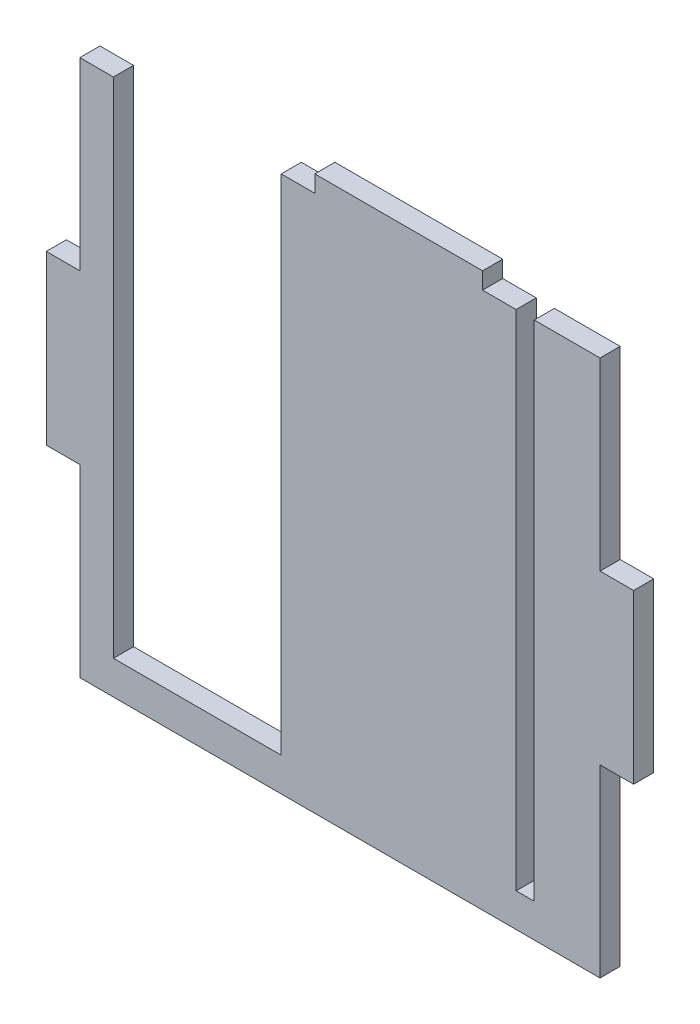
ISO-10303-21;
HEADER;
FILE_DESCRIPTION(('STEP AP214'),'2;1');
FILE_NAME('part.step','',(''),(''),'','','');
FILE_SCHEMA(('AUTOMOTIVE_DESIGN { 1 0 10303 214 1 1 1 1 }'));
ENDSEC;
DATA;
#1=APPLICATION_CONTEXT('core data for automotive mechanical design processes');
#2=APPLICATION_PROTOCOL_DEFINITION('international standard','automotive_design',2000,#1);
#3=PRODUCT_CONTEXT('',#1,'mechanical');
#4=PRODUCT('Part','Part','',(#3));
#5=PRODUCT_RELATED_PRODUCT_CATEGORY('part','',(#4));
#6=PRODUCT_DEFINITION_FORMATION('','',#4);
#7=PRODUCT_DEFINITION_CONTEXT('part definition',#1,'design');
#8=PRODUCT_DEFINITION('design','',#6,#7);
#9=PRODUCT_DEFINITION_SHAPE('','',#8);
#10=(LENGTH_UNIT() NAMED_UNIT(*) SI_UNIT(.MILLI.,.METRE.));
#11=(NAMED_UNIT(*) PLANE_ANGLE_UNIT() SI_UNIT($,.RADIAN.));
#12=(NAMED_UNIT(*) SI_UNIT($,.STERADIAN.) SOLID_ANGLE_UNIT());
#13=UNCERTAINTY_MEASURE_WITH_UNIT(LENGTH_MEASURE(1.E-05),#10,'distance_accuracy_value','');
#14=(GEOMETRIC_REPRESENTATION_CONTEXT(3) GLOBAL_UNCERTAINTY_ASSIGNED_CONTEXT((#13)) GLOBAL_UNIT_ASSIGNED_CONTEXT((#10,
#11,#12)) REPRESENTATION_CONTEXT('',''));
#15=CARTESIAN_POINT('',(0.,0.,0.));
#16=DIRECTION('',(0.,0.,1.));
#17=DIRECTION('',(1.,0.,0.));
#18=AXIS2_PLACEMENT_3D('',#15,#16,#17);
#19=CARTESIAN_POINT('',(0.,160.,6.));
#20=DIRECTION('',(0.,-1.,0.));
#21=DIRECTION('',(1.,0.,0.));
#22=AXIS2_PLACEMENT_3D('',#19,#20,#21);
#23=PLANE('',#22);
#24=DIRECTION('',(0.,0.,-1.));
#25=VECTOR('',#24,1.);
#26=CARTESIAN_POINT('',(-35.,160.,6.));
#27=LINE('',#26,#25);
#28=CARTESIAN_POINT('',(-35.,160.,6.));
#29=VERTEX_POINT('',#28);
#30=CARTESIAN_POINT('',(-35.,160.,0.));
#31=VERTEX_POINT('',#30);
#32=EDGE_CURVE('E128',#29,#31,#27,.T.);
#33=ORIENTED_EDGE('',*,*,#32,.F.);
#34=DIRECTION('',(-1.,0.,0.));
#35=VECTOR('',#34,1.);
#36=CARTESIAN_POINT('',(0.,160.,6.));
#37=LINE('',#36,#35);
#38=CARTESIAN_POINT('',(-25.,160.,6.));
#39=VERTEX_POINT('',#38);
#40=EDGE_CURVE('E407',#39,#29,#37,.T.);
#41=ORIENTED_EDGE('',*,*,#40,.F.);
#42=DIRECTION('',(0.,0.,-1.));
#43=VECTOR('',#42,1.);
#44=CARTESIAN_POINT('',(-25.,160.,6.));
#45=LINE('',#44,#43);
#46=CARTESIAN_POINT('',(-25.,160.,0.));
#47=VERTEX_POINT('',#46);
#48=EDGE_CURVE('E271',#39,#47,#45,.T.);
#49=ORIENTED_EDGE('',*,*,#48,.T.);
#50=DIRECTION('',(-1.,0.,0.));
#51=VECTOR('',#50,1.);
#52=CARTESIAN_POINT('',(0.,160.,0.));
#53=LINE('',#52,#51);
#54=EDGE_CURVE('E341',#47,#31,#53,.T.);
#55=ORIENTED_EDGE('',*,*,#54,.T.);
#56=EDGE_LOOP('',(#33,#41,#49,#55));
#57=FACE_BOUND('',#56,.T.);
#58=ADVANCED_FACE('F117',(#57),#23,.F.);
#59=CARTESIAN_POINT('',(-85.,160.,6.));
#60=VERTEX_POINT('',#59);
#61=CARTESIAN_POINT('',(-95.0000000000001,160.,6.));
#62=VERTEX_POINT('',#61);
#63=EDGE_CURVE('E280',#60,#62,#37,.T.);
#64=ORIENTED_EDGE('',*,*,#63,.F.);
#65=DIRECTION('',(0.,0.,-1.));
#66=VECTOR('',#65,1.);
#67=CARTESIAN_POINT('',(-85.,160.,6.));
#68=LINE('',#67,#66);
#69=CARTESIAN_POINT('',(-85.,160.,0.));
#70=VERTEX_POINT('',#69);
#71=EDGE_CURVE('E12',#60,#70,#68,.T.);
#72=ORIENTED_EDGE('',*,*,#71,.T.);
#73=CARTESIAN_POINT('',(-95.0000000000001,160.,0.));
#74=VERTEX_POINT('',#73);
#75=EDGE_CURVE('E166',#70,#74,#53,.T.);
#76=ORIENTED_EDGE('',*,*,#75,.T.);
#77=DIRECTION('',(0.,0.,-1.));
#78=VECTOR('',#77,1.);
#79=CARTESIAN_POINT('',(-95.0000000000001,160.,6.));
#80=LINE('',#79,#78);
#81=EDGE_CURVE('E195',#62,#74,#80,.T.);
#82=ORIENTED_EDGE('',*,*,#81,.F.);
#83=EDGE_LOOP('',(#64,#72,#76,#82));
#84=FACE_BOUND('',#83,.T.);
#85=ADVANCED_FACE('F504',(#84),#23,.F.);
#86=CARTESIAN_POINT('',(-95.0000000000001,0.,6.));
#87=DIRECTION('',(1.,0.,0.));
#88=DIRECTION('',(0.,0.,-1.));
#89=AXIS2_PLACEMENT_3D('',#86,#87,#88);
#90=PLANE('',#89);
#91=DIRECTION('',(0.,-1.,0.));
#92=VECTOR('',#91,1.);
#93=CARTESIAN_POINT('',(-95.0000000000001,0.,0.));
#94=LINE('',#93,#92);
#95=CARTESIAN_POINT('',(-95.0000000000001,9.99999999999998,0.));
#96=VERTEX_POINT('',#95);
#97=EDGE_CURVE('E337',#74,#96,#94,.T.);
#98=ORIENTED_EDGE('',*,*,#97,.T.);
#99=DIRECTION('',(0.,0.,-1.));
#100=VECTOR('',#99,1.);
#101=CARTESIAN_POINT('',(-95.0000000000001,9.99999999999998,6.));
#102=LINE('',#101,#100);
#103=CARTESIAN_POINT('',(-95.0000000000001,9.99999999999998,6.));
#104=VERTEX_POINT('',#103);
#105=EDGE_CURVE('E199',#104,#96,#102,.T.);
#106=ORIENTED_EDGE('',*,*,#105,.F.);
#107=DIRECTION('',(0.,-1.,0.));
#108=VECTOR('',#107,1.);
#109=CARTESIAN_POINT('',(-95.0000000000001,0.,6.));
#110=LINE('',#109,#108);
#111=EDGE_CURVE('E403',#62,#104,#110,.T.);
#112=ORIENTED_EDGE('',*,*,#111,.F.);
#113=ORIENTED_EDGE('',*,*,#81,.T.);
#114=EDGE_LOOP('',(#98,#106,#112,#113));
#115=FACE_BOUND('',#114,.T.);
#116=ADVANCED_FACE('F568',(#115),#90,.F.);
#117=CARTESIAN_POINT('',(0.,9.99999999999998,6.));
#118=DIRECTION('',(0.,1.,0.));
#119=DIRECTION('',(0.,0.,1.));
#120=AXIS2_PLACEMENT_3D('',#117,#118,#119);
#121=PLANE('',#120);
#122=DIRECTION('',(1.,0.,0.));
#123=VECTOR('',#122,1.);
#124=CARTESIAN_POINT('',(0.,9.99999999999998,0.));
#125=LINE('',#124,#123);
#126=CARTESIAN_POINT('',(-145.,9.99999999999998,0.));
#127=VERTEX_POINT('',#126);
#128=EDGE_CURVE('E333',#127,#96,#125,.T.);
#129=ORIENTED_EDGE('',*,*,#128,.F.);
#130=DIRECTION('',(0.,0.,-1.));
#131=VECTOR('',#130,1.);
#132=CARTESIAN_POINT('',(-145.,9.99999999999998,6.));
#133=LINE('',#132,#131);
#134=CARTESIAN_POINT('',(-145.,9.99999999999998,6.));
#135=VERTEX_POINT('',#134);
#136=EDGE_CURVE('E203',#135,#127,#133,.T.);
#137=ORIENTED_EDGE('',*,*,#136,.F.);
#138=DIRECTION('',(1.,0.,0.));
#139=VECTOR('',#138,1.);
#140=CARTESIAN_POINT('',(0.,9.99999999999998,6.));
#141=LINE('',#140,#139);
#142=EDGE_CURVE('E399',#135,#104,#141,.T.);
#143=ORIENTED_EDGE('',*,*,#142,.T.);
#144=ORIENTED_EDGE('',*,*,#105,.T.);
#145=EDGE_LOOP('',(#129,#137,#143,#144));
#146=FACE_BOUND('',#145,.T.);
#147=ADVANCED_FACE('F574',(#146),#121,.T.);
#148=CARTESIAN_POINT('',(-145.,0.,6.));
#149=DIRECTION('',(1.,0.,0.));
#150=DIRECTION('',(0.,0.,-1.));
#151=AXIS2_PLACEMENT_3D('',#148,#149,#150);
#152=PLANE('',#151);
#153=DIRECTION('',(0.,-1.,0.));
#154=VECTOR('',#153,1.);
#155=CARTESIAN_POINT('',(-145.,0.,0.));
#156=LINE('',#155,#154);
#157=CARTESIAN_POINT('',(-145.,160.,0.));
#158=VERTEX_POINT('',#157);
#159=EDGE_CURVE('E329',#158,#127,#156,.T.);
#160=ORIENTED_EDGE('',*,*,#159,.F.);
#161=DIRECTION('',(0.,0.,-1.));
#162=VECTOR('',#161,1.);
#163=CARTESIAN_POINT('',(-145.,160.,6.));
#164=LINE('',#163,#162);
#165=CARTESIAN_POINT('',(-145.,160.,6.));
#166=VERTEX_POINT('',#165);
#167=EDGE_CURVE('E207',#166,#158,#164,.T.);
#168=ORIENTED_EDGE('',*,*,#167,.F.);
#169=DIRECTION('',(0.,-1.,0.));
#170=VECTOR('',#169,1.);
#171=CARTESIAN_POINT('',(-145.,0.,6.));
#172=LINE('',#171,#170);
#173=EDGE_CURVE('E395',#166,#135,#172,.T.);
#174=ORIENTED_EDGE('',*,*,#173,.T.);
#175=ORIENTED_EDGE('',*,*,#136,.T.);
#176=EDGE_LOOP('',(#160,#168,#174,#175));
#177=FACE_BOUND('',#176,.T.);
#178=ADVANCED_FACE('F577',(#177),#152,.T.);
#179=CARTESIAN_POINT('',(-155.,160.,0.));
#180=VERTEX_POINT('',#179);
#181=EDGE_CURVE('E328',#158,#180,#53,.T.);
#182=ORIENTED_EDGE('',*,*,#181,.T.);
#183=DIRECTION('',(0.,0.,-1.));
#184=VECTOR('',#183,1.);
#185=CARTESIAN_POINT('',(-155.,160.,6.));
#186=LINE('',#185,#184);
#187=CARTESIAN_POINT('',(-155.,160.,6.));
#188=VERTEX_POINT('',#187);
#189=EDGE_CURVE('E211',#188,#180,#186,.T.);
#190=ORIENTED_EDGE('',*,*,#189,.F.);
#191=EDGE_CURVE('E394',#166,#188,#37,.T.);
#192=ORIENTED_EDGE('',*,*,#191,.F.);
#193=ORIENTED_EDGE('',*,*,#167,.T.);
#194=EDGE_LOOP('',(#182,#190,#192,#193));
#195=FACE_BOUND('',#194,.T.);
#196=ADVANCED_FACE('F514',(#195),#23,.F.);
#197=CARTESIAN_POINT('',(-155.,0.,6.));
#198=DIRECTION('',(-1.,0.,0.));
#199=DIRECTION('',(0.,0.,1.));
#200=AXIS2_PLACEMENT_3D('',#197,#198,#199);
#201=PLANE('',#200);
#202=DIRECTION('',(0.,1.,0.));
#203=VECTOR('',#202,1.);
#204=CARTESIAN_POINT('',(-155.,0.,0.));
#205=LINE('',#204,#203);
#206=CARTESIAN_POINT('',(-155.,105.,0.));
#207=VERTEX_POINT('',#206);
#208=EDGE_CURVE('E324',#207,#180,#205,.T.);
#209=ORIENTED_EDGE('',*,*,#208,.F.);
#210=DIRECTION('',(0.,0.,-1.));
#211=VECTOR('',#210,1.);
#212=CARTESIAN_POINT('',(-155.,105.,6.));
#213=LINE('',#212,#211);
#214=CARTESIAN_POINT('',(-155.,105.,6.));
#215=VERTEX_POINT('',#214);
#216=EDGE_CURVE('E215',#215,#207,#213,.T.);
#217=ORIENTED_EDGE('',*,*,#216,.F.);
#218=DIRECTION('',(0.,1.,0.));
#219=VECTOR('',#218,1.);
#220=CARTESIAN_POINT('',(-155.,0.,6.));
#221=LINE('',#220,#219);
#222=EDGE_CURVE('E390',#215,#188,#221,.T.);
#223=ORIENTED_EDGE('',*,*,#222,.T.);
#224=ORIENTED_EDGE('',*,*,#189,.T.);
#225=EDGE_LOOP('',(#209,#217,#223,#224));
#226=FACE_BOUND('',#225,.T.);
#227=ADVANCED_FACE('F522',(#226),#201,.T.);
#228=CARTESIAN_POINT('',(0.,105.,6.));
#229=DIRECTION('',(0.,-1.,0.));
#230=DIRECTION('',(0.,0.,-1.));
#231=AXIS2_PLACEMENT_3D('',#228,#229,#230);
#232=PLANE('',#231);
#233=DIRECTION('',(-1.,0.,0.));
#234=VECTOR('',#233,1.);
#235=CARTESIAN_POINT('',(0.,105.,0.));
#236=LINE('',#235,#234);
#237=CARTESIAN_POINT('',(-165.,105.,0.));
#238=VERTEX_POINT('',#237);
#239=EDGE_CURVE('E320',#207,#238,#236,.T.);
#240=ORIENTED_EDGE('',*,*,#239,.T.);
#241=DIRECTION('',(0.,0.,-1.));
#242=VECTOR('',#241,1.);
#243=CARTESIAN_POINT('',(-165.,105.,6.));
#244=LINE('',#243,#242);
#245=CARTESIAN_POINT('',(-165.,105.,6.));
#246=VERTEX_POINT('',#245);
#247=EDGE_CURVE('E219',#246,#238,#244,.T.);
#248=ORIENTED_EDGE('',*,*,#247,.F.);
#249=DIRECTION('',(-1.,0.,0.));
#250=VECTOR('',#249,1.);
#251=CARTESIAN_POINT('',(0.,105.,6.));
#252=LINE('',#251,#250);
#253=EDGE_CURVE('E386',#215,#246,#252,.T.);
#254=ORIENTED_EDGE('',*,*,#253,.F.);
#255=ORIENTED_EDGE('',*,*,#216,.T.);
#256=EDGE_LOOP('',(#240,#248,#254,#255));
#257=FACE_BOUND('',#256,.T.);
#258=ADVANCED_FACE('F636',(#257),#232,.F.);
#259=CARTESIAN_POINT('',(-165.,0.,6.));
#260=DIRECTION('',(1.,0.,0.));
#261=DIRECTION('',(0.,0.,-1.));
#262=AXIS2_PLACEMENT_3D('',#259,#260,#261);
#263=PLANE('',#262);
#264=DIRECTION('',(0.,-1.,0.));
#265=VECTOR('',#264,1.);
#266=CARTESIAN_POINT('',(-165.,0.,0.));
#267=LINE('',#266,#265);
#268=CARTESIAN_POINT('',(-165.,55.,0.));
#269=VERTEX_POINT('',#268);
#270=EDGE_CURVE('E316',#238,#269,#267,.T.);
#271=ORIENTED_EDGE('',*,*,#270,.T.);
#272=DIRECTION('',(0.,0.,-1.));
#273=VECTOR('',#272,1.);
#274=CARTESIAN_POINT('',(-165.,55.,6.));
#275=LINE('',#274,#273);
#276=CARTESIAN_POINT('',(-165.,55.,6.));
#277=VERTEX_POINT('',#276);
#278=EDGE_CURVE('E223',#277,#269,#275,.T.);
#279=ORIENTED_EDGE('',*,*,#278,.F.);
#280=DIRECTION('',(0.,-1.,0.));
#281=VECTOR('',#280,1.);
#282=CARTESIAN_POINT('',(-165.,0.,6.));
#283=LINE('',#282,#281);
#284=EDGE_CURVE('E382',#246,#277,#283,.T.);
#285=ORIENTED_EDGE('',*,*,#284,.F.);
#286=ORIENTED_EDGE('',*,*,#247,.T.);
#287=EDGE_LOOP('',(#271,#279,#285,#286));
#288=FACE_BOUND('',#287,.T.);
#289=ADVANCED_FACE('F633',(#288),#263,.F.);
#290=CARTESIAN_POINT('',(0.,55.,6.));
#291=DIRECTION('',(0.,-1.,0.));
#292=DIRECTION('',(0.,0.,-1.));
#293=AXIS2_PLACEMENT_3D('',#290,#291,#292);
#294=PLANE('',#293);
#295=DIRECTION('',(-1.,0.,0.));
#296=VECTOR('',#295,1.);
#297=CARTESIAN_POINT('',(0.,55.,0.));
#298=LINE('',#297,#296);
#299=CARTESIAN_POINT('',(-155.,55.,0.));
#300=VERTEX_POINT('',#299);
#301=EDGE_CURVE('E312',#300,#269,#298,.T.);
#302=ORIENTED_EDGE('',*,*,#301,.F.);
#303=DIRECTION('',(0.,0.,-1.));
#304=VECTOR('',#303,1.);
#305=CARTESIAN_POINT('',(-155.,55.,6.));
#306=LINE('',#305,#304);
#307=CARTESIAN_POINT('',(-155.,55.,6.));
#308=VERTEX_POINT('',#307);
#309=EDGE_CURVE('E227',#308,#300,#306,.T.);
#310=ORIENTED_EDGE('',*,*,#309,.F.);
#311=DIRECTION('',(-1.,0.,0.));
#312=VECTOR('',#311,1.);
#313=CARTESIAN_POINT('',(0.,55.,6.));
#314=LINE('',#313,#312);
#315=EDGE_CURVE('E378',#308,#277,#314,.T.);
#316=ORIENTED_EDGE('',*,*,#315,.T.);
#317=ORIENTED_EDGE('',*,*,#278,.T.);
#318=EDGE_LOOP('',(#302,#310,#316,#317));
#319=FACE_BOUND('',#318,.T.);
#320=ADVANCED_FACE('F629',(#319),#294,.T.);
#321=CARTESIAN_POINT('',(-155.,0.,0.));
#322=VERTEX_POINT('',#321);
#323=EDGE_CURVE('E311',#322,#300,#205,.T.);
#324=ORIENTED_EDGE('',*,*,#323,.F.);
#325=DIRECTION('',(0.,0.,-1.));
#326=VECTOR('',#325,1.);
#327=CARTESIAN_POINT('',(-155.,0.,6.));
#328=LINE('',#327,#326);
#329=CARTESIAN_POINT('',(-155.,0.,6.));
#330=VERTEX_POINT('',#329);
#331=EDGE_CURVE('E231',#330,#322,#328,.T.);
#332=ORIENTED_EDGE('',*,*,#331,.F.);
#333=EDGE_CURVE('E377',#330,#308,#221,.T.);
#334=ORIENTED_EDGE('',*,*,#333,.T.);
#335=ORIENTED_EDGE('',*,*,#309,.T.);
#336=EDGE_LOOP('',(#324,#332,#334,#335));
#337=FACE_BOUND('',#336,.T.);
#338=ADVANCED_FACE('F625',(#337),#201,.T.);
#339=CARTESIAN_POINT('',(0.,0.,6.));
#340=DIRECTION('',(0.,-1.,0.));
#341=DIRECTION('',(1.,0.,0.));
#342=AXIS2_PLACEMENT_3D('',#339,#340,#341);
#343=PLANE('',#342);
#344=DIRECTION('',(-1.,0.,0.));
#345=VECTOR('',#344,1.);
#346=CARTESIAN_POINT('',(0.,0.,0.));
#347=LINE('',#346,#345);
#348=CARTESIAN_POINT('',(0.,0.,0.));
#349=VERTEX_POINT('',#348);
#350=EDGE_CURVE('E307',#349,#322,#347,.T.);
#351=ORIENTED_EDGE('',*,*,#350,.F.);
#352=DIRECTION('',(0.,0.,-1.));
#353=VECTOR('',#352,1.);
#354=CARTESIAN_POINT('',(0.,0.,6.));
#355=LINE('',#354,#353);
#356=CARTESIAN_POINT('',(0.,0.,6.));
#357=VERTEX_POINT('',#356);
#358=EDGE_CURVE('E235',#357,#349,#355,.T.);
#359=ORIENTED_EDGE('',*,*,#358,.F.);
#360=DIRECTION('',(-1.,0.,0.));
#361=VECTOR('',#360,1.);
#362=CARTESIAN_POINT('',(0.,0.,6.));
#363=LINE('',#362,#361);
#364=EDGE_CURVE('E373',#357,#330,#363,.T.);
#365=ORIENTED_EDGE('',*,*,#364,.T.);
#366=ORIENTED_EDGE('',*,*,#331,.T.);
#367=EDGE_LOOP('',(#351,#359,#365,#366));
#368=FACE_BOUND('',#367,.T.);
#369=ADVANCED_FACE('F622',(#368),#343,.T.);
#370=CARTESIAN_POINT('',(0.,0.,6.));
#371=DIRECTION('',(-1.,0.,0.));
#372=DIRECTION('',(0.,-1.,0.));
#373=AXIS2_PLACEMENT_3D('',#370,#371,#372);
#374=PLANE('',#373);
#375=DIRECTION('',(0.,1.,0.));
#376=VECTOR('',#375,1.);
#377=CARTESIAN_POINT('',(0.,0.,0.));
#378=LINE('',#377,#376);
#379=CARTESIAN_POINT('',(0.,55.0000000000001,0.));
#380=VERTEX_POINT('',#379);
#381=EDGE_CURVE('E303',#349,#380,#378,.T.);
#382=ORIENTED_EDGE('',*,*,#381,.T.);
#383=DIRECTION('',(0.,0.,-1.));
#384=VECTOR('',#383,1.);
#385=CARTESIAN_POINT('',(0.,55.0000000000001,6.));
#386=LINE('',#385,#384);
#387=CARTESIAN_POINT('',(0.,55.0000000000001,6.));
#388=VERTEX_POINT('',#387);
#389=EDGE_CURVE('E239',#388,#380,#386,.T.);
#390=ORIENTED_EDGE('',*,*,#389,.F.);
#391=DIRECTION('',(0.,1.,0.));
#392=VECTOR('',#391,1.);
#393=CARTESIAN_POINT('',(0.,0.,6.));
#394=LINE('',#393,#392);
#395=EDGE_CURVE('E369',#357,#388,#394,.T.);
#396=ORIENTED_EDGE('',*,*,#395,.F.);
#397=ORIENTED_EDGE('',*,*,#358,.T.);
#398=EDGE_LOOP('',(#382,#390,#396,#397));
#399=FACE_BOUND('',#398,.T.);
#400=ADVANCED_FACE('F611',(#399),#374,.F.);
#401=CARTESIAN_POINT('',(0.,55.0000000000001,6.));
#402=DIRECTION('',(0.,1.,0.));
#403=DIRECTION('',(0.,0.,1.));
#404=AXIS2_PLACEMENT_3D('',#401,#402,#403);
#405=PLANE('',#404);
#406=DIRECTION('',(1.,0.,0.));
#407=VECTOR('',#406,1.);
#408=CARTESIAN_POINT('',(0.,55.0000000000001,0.));
#409=LINE('',#408,#407);
#410=CARTESIAN_POINT('',(10.,55.0000000000001,0.));
#411=VERTEX_POINT('',#410);
#412=EDGE_CURVE('E299',#380,#411,#409,.T.);
#413=ORIENTED_EDGE('',*,*,#412,.T.);
#414=DIRECTION('',(0.,0.,-1.));
#415=VECTOR('',#414,1.);
#416=CARTESIAN_POINT('',(10.,55.0000000000001,6.));
#417=LINE('',#416,#415);
#418=CARTESIAN_POINT('',(10.,55.0000000000001,6.));
#419=VERTEX_POINT('',#418);
#420=EDGE_CURVE('E243',#419,#411,#417,.T.);
#421=ORIENTED_EDGE('',*,*,#420,.F.);
#422=DIRECTION('',(1.,0.,0.));
#423=VECTOR('',#422,1.);
#424=CARTESIAN_POINT('',(0.,55.0000000000001,6.));
#425=LINE('',#424,#423);
#426=EDGE_CURVE('E365',#388,#419,#425,.T.);
#427=ORIENTED_EDGE('',*,*,#426,.F.);
#428=ORIENTED_EDGE('',*,*,#389,.T.);
#429=EDGE_LOOP('',(#413,#421,#427,#428));
#430=FACE_BOUND('',#429,.T.);
#431=ADVANCED_FACE('F617',(#430),#405,.F.);
#432=CARTESIAN_POINT('',(10.,0.,6.));
#433=DIRECTION('',(1.,0.,0.));
#434=DIRECTION('',(0.,0.,-1.));
#435=AXIS2_PLACEMENT_3D('',#432,#433,#434);
#436=PLANE('',#435);
#437=DIRECTION('',(0.,-1.,0.));
#438=VECTOR('',#437,1.);
#439=CARTESIAN_POINT('',(10.,0.,0.));
#440=LINE('',#439,#438);
#441=CARTESIAN_POINT('',(10.,105.,0.));
#442=VERTEX_POINT('',#441);
#443=EDGE_CURVE('E295',#442,#411,#440,.T.);
#444=ORIENTED_EDGE('',*,*,#443,.F.);
#445=DIRECTION('',(0.,0.,-1.));
#446=VECTOR('',#445,1.);
#447=CARTESIAN_POINT('',(10.,105.,6.));
#448=LINE('',#447,#446);
#449=CARTESIAN_POINT('',(10.,105.,6.));
#450=VERTEX_POINT('',#449);
#451=EDGE_CURVE('E247',#450,#442,#448,.T.);
#452=ORIENTED_EDGE('',*,*,#451,.F.);
#453=DIRECTION('',(0.,-1.,0.));
#454=VECTOR('',#453,1.);
#455=CARTESIAN_POINT('',(10.,0.,6.));
#456=LINE('',#455,#454);
#457=EDGE_CURVE('E361',#450,#419,#456,.T.);
#458=ORIENTED_EDGE('',*,*,#457,.T.);
#459=ORIENTED_EDGE('',*,*,#420,.T.);
#460=EDGE_LOOP('',(#444,#452,#458,#459));
#461=FACE_BOUND('',#460,.T.);
#462=ADVANCED_FACE('F614',(#461),#436,.T.);
#463=CARTESIAN_POINT('',(0.,105.,6.));
#464=DIRECTION('',(0.,1.,0.));
#465=DIRECTION('',(0.,0.,1.));
#466=AXIS2_PLACEMENT_3D('',#463,#464,#465);
#467=PLANE('',#466);
#468=DIRECTION('',(1.,0.,0.));
#469=VECTOR('',#468,1.);
#470=CARTESIAN_POINT('',(0.,105.,0.));
#471=LINE('',#470,#469);
#472=CARTESIAN_POINT('',(0.,105.,0.));
#473=VERTEX_POINT('',#472);
#474=EDGE_CURVE('E290',#473,#442,#471,.T.);
#475=ORIENTED_EDGE('',*,*,#474,.F.);
#476=DIRECTION('',(0.,0.,-1.));
#477=VECTOR('',#476,1.);
#478=CARTESIAN_POINT('',(0.,105.,6.));
#479=LINE('',#478,#477);
#480=CARTESIAN_POINT('',(0.,105.,6.));
#481=VERTEX_POINT('',#480);
#482=EDGE_CURVE('E251',#481,#473,#479,.T.);
#483=ORIENTED_EDGE('',*,*,#482,.F.);
#484=DIRECTION('',(1.,0.,0.));
#485=VECTOR('',#484,1.);
#486=CARTESIAN_POINT('',(0.,105.,6.));
#487=LINE('',#486,#485);
#488=EDGE_CURVE('E356',#481,#450,#487,.T.);
#489=ORIENTED_EDGE('',*,*,#488,.T.);
#490=ORIENTED_EDGE('',*,*,#451,.T.);
#491=EDGE_LOOP('',(#475,#483,#489,#490));
#492=FACE_BOUND('',#491,.T.);
#493=ADVANCED_FACE('F554',(#492),#467,.T.);
#494=CARTESIAN_POINT('',(0.,160.,0.));
#495=VERTEX_POINT('',#494);
#496=EDGE_CURVE('E294',#473,#495,#378,.T.);
#497=ORIENTED_EDGE('',*,*,#496,.T.);
#498=DIRECTION('',(0.,0.,-1.));
#499=VECTOR('',#498,1.);
#500=CARTESIAN_POINT('',(0.,160.,6.));
#501=LINE('',#500,#499);
#502=CARTESIAN_POINT('',(0.,160.,6.));
#503=VERTEX_POINT('',#502);
#504=EDGE_CURVE('E255',#503,#495,#501,.T.);
#505=ORIENTED_EDGE('',*,*,#504,.F.);
#506=EDGE_CURVE('E360',#481,#503,#394,.T.);
#507=ORIENTED_EDGE('',*,*,#506,.F.);
#508=ORIENTED_EDGE('',*,*,#482,.T.);
#509=EDGE_LOOP('',(#497,#505,#507,#508));
#510=FACE_BOUND('',#509,.T.);
#511=ADVANCED_FACE('F439',(#510),#374,.F.);
#512=CARTESIAN_POINT('',(-19.6000000000001,160.,0.));
#513=VERTEX_POINT('',#512);
#514=EDGE_CURVE('E289',#495,#513,#53,.T.);
#515=ORIENTED_EDGE('',*,*,#514,.T.);
#516=DIRECTION('',(0.,0.,-1.));
#517=VECTOR('',#516,1.);
#518=CARTESIAN_POINT('',(-19.6000000000001,160.,6.));
#519=LINE('',#518,#517);
#520=CARTESIAN_POINT('',(-19.6000000000001,160.,6.));
#521=VERTEX_POINT('',#520);
#522=EDGE_CURVE('E259',#521,#513,#519,.T.);
#523=ORIENTED_EDGE('',*,*,#522,.F.);
#524=EDGE_CURVE('E355',#503,#521,#37,.T.);
#525=ORIENTED_EDGE('',*,*,#524,.F.);
#526=ORIENTED_EDGE('',*,*,#504,.T.);
#527=EDGE_LOOP('',(#515,#523,#525,#526));
#528=FACE_BOUND('',#527,.T.);
#529=ADVANCED_FACE('F445',(#528),#23,.F.);
#530=CARTESIAN_POINT('',(-19.6,0.,6.));
#531=DIRECTION('',(1.,0.,0.));
#532=DIRECTION('',(0.,1.,0.));
#533=AXIS2_PLACEMENT_3D('',#530,#531,#532);
#534=PLANE('',#533);
#535=DIRECTION('',(0.,-1.,0.));
#536=VECTOR('',#535,1.);
#537=CARTESIAN_POINT('',(-19.6,0.,0.));
#538=LINE('',#537,#536);
#539=CARTESIAN_POINT('',(-19.6,9.99999999999999,0.));
#540=VERTEX_POINT('',#539);
#541=EDGE_CURVE('E285',#513,#540,#538,.T.);
#542=ORIENTED_EDGE('',*,*,#541,.T.);
#543=DIRECTION('',(0.,0.,-1.));
#544=VECTOR('',#543,1.);
#545=CARTESIAN_POINT('',(-19.6,9.99999999999999,6.));
#546=LINE('',#545,#544);
#547=CARTESIAN_POINT('',(-19.6,9.99999999999999,6.));
#548=VERTEX_POINT('',#547);
#549=EDGE_CURVE('E263',#548,#540,#546,.T.);
#550=ORIENTED_EDGE('',*,*,#549,.F.);
#551=DIRECTION('',(0.,-1.,0.));
#552=VECTOR('',#551,1.);
#553=CARTESIAN_POINT('',(-19.6,0.,6.));
#554=LINE('',#553,#552);
#555=EDGE_CURVE('E351',#521,#548,#554,.T.);
#556=ORIENTED_EDGE('',*,*,#555,.F.);
#557=ORIENTED_EDGE('',*,*,#522,.T.);
#558=EDGE_LOOP('',(#542,#550,#556,#557));
#559=FACE_BOUND('',#558,.T.);
#560=ADVANCED_FACE('F453',(#559),#534,.F.);
#561=CARTESIAN_POINT('',(0.,9.99999999999999,6.));
#562=DIRECTION('',(0.,-1.,0.));
#563=DIRECTION('',(0.,0.,-1.));
#564=AXIS2_PLACEMENT_3D('',#561,#562,#563);
#565=PLANE('',#564);
#566=DIRECTION('',(-1.,0.,0.));
#567=VECTOR('',#566,1.);
#568=CARTESIAN_POINT('',(0.,9.99999999999999,0.));
#569=LINE('',#568,#567);
#570=CARTESIAN_POINT('',(-25.,9.99999999999999,0.));
#571=VERTEX_POINT('',#570);
#572=EDGE_CURVE('E281',#540,#571,#569,.T.);
#573=ORIENTED_EDGE('',*,*,#572,.T.);
#574=DIRECTION('',(0.,0.,-1.));
#575=VECTOR('',#574,1.);
#576=CARTESIAN_POINT('',(-25.,9.99999999999999,6.));
#577=LINE('',#576,#575);
#578=CARTESIAN_POINT('',(-25.,9.99999999999999,6.));
#579=VERTEX_POINT('',#578);
#580=EDGE_CURVE('E267',#579,#571,#577,.T.);
#581=ORIENTED_EDGE('',*,*,#580,.F.);
#582=DIRECTION('',(-1.,0.,0.));
#583=VECTOR('',#582,1.);
#584=CARTESIAN_POINT('',(0.,9.99999999999999,6.));
#585=LINE('',#584,#583);
#586=EDGE_CURVE('E347',#548,#579,#585,.T.);
#587=ORIENTED_EDGE('',*,*,#586,.F.);
#588=ORIENTED_EDGE('',*,*,#549,.T.);
#589=EDGE_LOOP('',(#573,#581,#587,#588));
#590=FACE_BOUND('',#589,.T.);
#591=ADVANCED_FACE('F557',(#590),#565,.F.);
#592=CARTESIAN_POINT('',(-25.,0.,6.));
#593=DIRECTION('',(1.,0.,0.));
#594=DIRECTION('',(0.,1.,0.));
#595=AXIS2_PLACEMENT_3D('',#592,#593,#594);
#596=PLANE('',#595);
#597=DIRECTION('',(0.,-1.,0.));
#598=VECTOR('',#597,1.);
#599=CARTESIAN_POINT('',(-25.,0.,0.));
#600=LINE('',#599,#598);
#601=EDGE_CURVE('E276',#47,#571,#600,.T.);
#602=ORIENTED_EDGE('',*,*,#601,.F.);
#603=ORIENTED_EDGE('',*,*,#48,.F.);
#604=DIRECTION('',(0.,-1.,0.));
#605=VECTOR('',#604,1.);
#606=CARTESIAN_POINT('',(-25.,0.,6.));
#607=LINE('',#606,#605);
#608=EDGE_CURVE('E275',#39,#579,#607,.T.);
#609=ORIENTED_EDGE('',*,*,#608,.T.);
#610=ORIENTED_EDGE('',*,*,#580,.T.);
#611=EDGE_LOOP('',(#602,#603,#609,#610));
#612=FACE_BOUND('',#611,.T.);
#613=ADVANCED_FACE('F560',(#612),#596,.T.);
#614=CARTESIAN_POINT('',(0.,0.,6.));
#615=DIRECTION('',(0.,0.,1.));
#616=DIRECTION('',(1.,0.,0.));
#617=AXIS2_PLACEMENT_3D('',#614,#615,#616);
#618=PLANE('',#617);
#619=ORIENTED_EDGE('',*,*,#40,.T.);
#620=DIRECTION('',(0.,1.,0.));
#621=VECTOR('',#620,1.);
#622=CARTESIAN_POINT('',(-35.,160.,6.));
#623=LINE('',#622,#621);
#624=CARTESIAN_POINT('',(-35.,165.,6.));
#625=VERTEX_POINT('',#624);
#626=EDGE_CURVE('E186',#29,#625,#623,.T.);
#627=ORIENTED_EDGE('',*,*,#626,.T.);
#628=DIRECTION('',(1.,0.,0.));
#629=VECTOR('',#628,1.);
#630=CARTESIAN_POINT('',(-85.,165.,6.));
#631=LINE('',#630,#629);
#632=CARTESIAN_POINT('',(-85.,165.,6.));
#633=VERTEX_POINT('',#632);
#634=EDGE_CURVE('E162',#633,#625,#631,.T.);
#635=ORIENTED_EDGE('',*,*,#634,.F.);
#636=DIRECTION('',(0.,1.,0.));
#637=VECTOR('',#636,1.);
#638=CARTESIAN_POINT('',(-85.,160.,6.));
#639=LINE('',#638,#637);
#640=EDGE_CURVE('E176',#60,#633,#639,.T.);
#641=ORIENTED_EDGE('',*,*,#640,.F.);
#642=ORIENTED_EDGE('',*,*,#63,.T.);
#643=ORIENTED_EDGE('',*,*,#111,.T.);
#644=ORIENTED_EDGE('',*,*,#142,.F.);
#645=ORIENTED_EDGE('',*,*,#173,.F.);
#646=ORIENTED_EDGE('',*,*,#191,.T.);
#647=ORIENTED_EDGE('',*,*,#222,.F.);
#648=ORIENTED_EDGE('',*,*,#253,.T.);
#649=ORIENTED_EDGE('',*,*,#284,.T.);
#650=ORIENTED_EDGE('',*,*,#315,.F.);
#651=ORIENTED_EDGE('',*,*,#333,.F.);
#652=ORIENTED_EDGE('',*,*,#364,.F.);
#653=ORIENTED_EDGE('',*,*,#395,.T.);
#654=ORIENTED_EDGE('',*,*,#426,.T.);
#655=ORIENTED_EDGE('',*,*,#457,.F.);
#656=ORIENTED_EDGE('',*,*,#488,.F.);
#657=ORIENTED_EDGE('',*,*,#506,.T.);
#658=ORIENTED_EDGE('',*,*,#524,.T.);
#659=ORIENTED_EDGE('',*,*,#555,.T.);
#660=ORIENTED_EDGE('',*,*,#586,.T.);
#661=ORIENTED_EDGE('',*,*,#608,.F.);
#662=EDGE_LOOP('',(#619,#627,#635,#641,#642,#643,#644,#645,#646,#647,#648,#649,#650,#651,#652,
#653,#654,#655,#656,#657,#658,#659,#660,#661));
#663=FACE_BOUND('',#662,.T.);
#664=ADVANCED_FACE('F433',(#663),#618,.T.);
#665=CARTESIAN_POINT('',(0.,0.,0.));
#666=DIRECTION('',(0.,0.,1.));
#667=DIRECTION('',(1.,0.,0.));
#668=AXIS2_PLACEMENT_3D('',#665,#666,#667);
#669=PLANE('',#668);
#670=ORIENTED_EDGE('',*,*,#54,.F.);
#671=ORIENTED_EDGE('',*,*,#601,.T.);
#672=ORIENTED_EDGE('',*,*,#572,.F.);
#673=ORIENTED_EDGE('',*,*,#541,.F.);
#674=ORIENTED_EDGE('',*,*,#514,.F.);
#675=ORIENTED_EDGE('',*,*,#496,.F.);
#676=ORIENTED_EDGE('',*,*,#474,.T.);
#677=ORIENTED_EDGE('',*,*,#443,.T.);
#678=ORIENTED_EDGE('',*,*,#412,.F.);
#679=ORIENTED_EDGE('',*,*,#381,.F.);
#680=ORIENTED_EDGE('',*,*,#350,.T.);
#681=ORIENTED_EDGE('',*,*,#323,.T.);
#682=ORIENTED_EDGE('',*,*,#301,.T.);
#683=ORIENTED_EDGE('',*,*,#270,.F.);
#684=ORIENTED_EDGE('',*,*,#239,.F.);
#685=ORIENTED_EDGE('',*,*,#208,.T.);
#686=ORIENTED_EDGE('',*,*,#181,.F.);
#687=ORIENTED_EDGE('',*,*,#159,.T.);
#688=ORIENTED_EDGE('',*,*,#128,.T.);
#689=ORIENTED_EDGE('',*,*,#97,.F.);
#690=ORIENTED_EDGE('',*,*,#75,.F.);
#691=DIRECTION('',(0.,1.,0.));
#692=VECTOR('',#691,1.);
#693=CARTESIAN_POINT('',(-85.,160.,0.));
#694=LINE('',#693,#692);
#695=CARTESIAN_POINT('',(-85.,165.,0.));
#696=VERTEX_POINT('',#695);
#697=EDGE_CURVE('E180',#70,#696,#694,.T.);
#698=ORIENTED_EDGE('',*,*,#697,.T.);
#699=DIRECTION('',(1.,0.,0.));
#700=VECTOR('',#699,1.);
#701=CARTESIAN_POINT('',(-85.,165.,0.));
#702=LINE('',#701,#700);
#703=CARTESIAN_POINT('',(-35.,165.,0.));
#704=VERTEX_POINT('',#703);
#705=EDGE_CURVE('E159',#696,#704,#702,.T.);
#706=ORIENTED_EDGE('',*,*,#705,.T.);
#707=DIRECTION('',(0.,1.,0.));
#708=VECTOR('',#707,1.);
#709=CARTESIAN_POINT('',(-35.,160.,0.));
#710=LINE('',#709,#708);
#711=EDGE_CURVE('E169',#31,#704,#710,.T.);
#712=ORIENTED_EDGE('',*,*,#711,.F.);
#713=EDGE_LOOP('',(#670,#671,#672,#673,#674,#675,#676,#677,#678,#679,#680,#681,#682,#683,#684,
#685,#686,#687,#688,#689,#690,#698,#706,#712));
#714=FACE_BOUND('',#713,.T.);
#715=ADVANCED_FACE('F178',(#714),#669,.F.);
#716=CARTESIAN_POINT('',(-35.,160.,6.));
#717=DIRECTION('',(-1.,0.,0.));
#718=DIRECTION('',(0.,0.,1.));
#719=AXIS2_PLACEMENT_3D('',#716,#717,#718);
#720=PLANE('',#719);
#721=ORIENTED_EDGE('',*,*,#711,.T.);
#722=DIRECTION('',(0.,0.,-1.));
#723=VECTOR('',#722,1.);
#724=CARTESIAN_POINT('',(-35.,165.,6.));
#725=LINE('',#724,#723);
#726=EDGE_CURVE('E155',#625,#704,#725,.T.);
#727=ORIENTED_EDGE('',*,*,#726,.F.);
#728=ORIENTED_EDGE('',*,*,#626,.F.);
#729=ORIENTED_EDGE('',*,*,#32,.T.);
#730=EDGE_LOOP('',(#721,#727,#728,#729));
#731=FACE_BOUND('',#730,.T.);
#732=ADVANCED_FACE('F170',(#731),#720,.F.);
#733=CARTESIAN_POINT('',(-85.,165.,6.));
#734=DIRECTION('',(0.,1.,0.));
#735=DIRECTION('',(0.,0.,1.));
#736=AXIS2_PLACEMENT_3D('',#733,#734,#735);
#737=PLANE('',#736);
#738=ORIENTED_EDGE('',*,*,#705,.F.);
#739=DIRECTION('',(0.,0.,-1.));
#740=VECTOR('',#739,1.);
#741=CARTESIAN_POINT('',(-85.,165.,6.));
#742=LINE('',#741,#740);
#743=EDGE_CURVE('E121',#633,#696,#742,.T.);
#744=ORIENTED_EDGE('',*,*,#743,.F.);
#745=ORIENTED_EDGE('',*,*,#634,.T.);
#746=ORIENTED_EDGE('',*,*,#726,.T.);
#747=EDGE_LOOP('',(#738,#744,#745,#746));
#748=FACE_BOUND('',#747,.T.);
#749=ADVANCED_FACE('F157',(#748),#737,.T.);
#750=CARTESIAN_POINT('',(-85.,160.,6.));
#751=DIRECTION('',(-1.,0.,0.));
#752=DIRECTION('',(0.,0.,1.));
#753=AXIS2_PLACEMENT_3D('',#750,#751,#752);
#754=PLANE('',#753);
#755=ORIENTED_EDGE('',*,*,#697,.F.);
#756=ORIENTED_EDGE('',*,*,#71,.F.);
#757=ORIENTED_EDGE('',*,*,#640,.T.);
#758=ORIENTED_EDGE('',*,*,#743,.T.);
#759=EDGE_LOOP('',(#755,#756,#757,#758));
#760=FACE_BOUND('',#759,.T.);
#761=ADVANCED_FACE('F119',(#760),#754,.T.);
#762=CLOSED_SHELL('',(#58,#85,#116,#147,#178,#196,#227,#258,#289,#320,#338,#369,#400,#431,#462,
#493,#511,#529,#560,#591,#613,#664,#715,#732,#749,#761));
#763=MANIFOLD_SOLID_BREP('B2',#762);
#764=ADVANCED_BREP_SHAPE_REPRESENTATION('',(#18,#763),#14);
#765=SHAPE_DEFINITION_REPRESENTATION(#9,#764);
ENDSEC;
END-ISO-10303-21;
